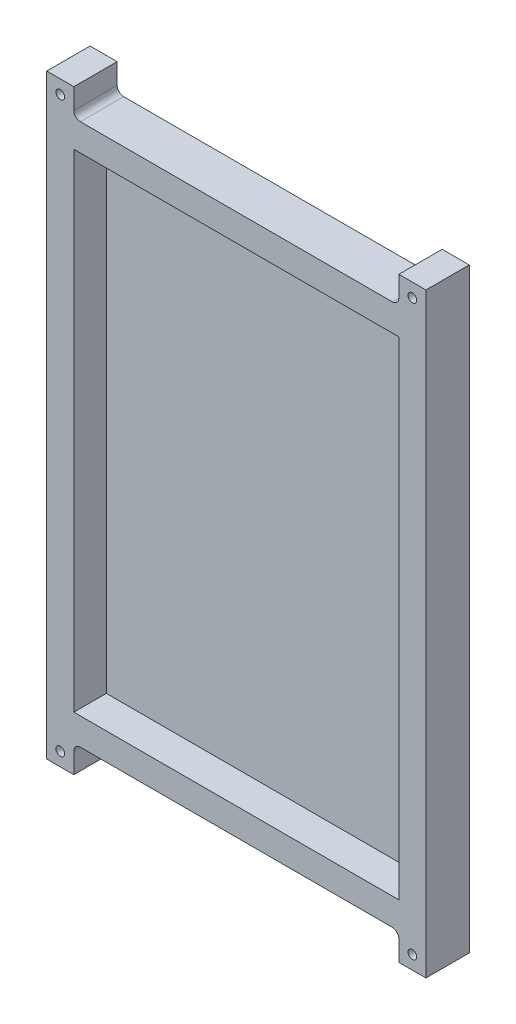
ISO-10303-21;
HEADER;
FILE_DESCRIPTION(('STEP AP214'),'2;1');
FILE_NAME('part.step','',(''),(''),'','','');
FILE_SCHEMA(('AUTOMOTIVE_DESIGN { 1 0 10303 214 1 1 1 1 }'));
ENDSEC;
DATA;
#1=APPLICATION_CONTEXT('core data for automotive mechanical design processes');
#2=APPLICATION_PROTOCOL_DEFINITION('international standard','automotive_design',2000,#1);
#3=PRODUCT_CONTEXT('',#1,'mechanical');
#4=PRODUCT('Part','Part','',(#3));
#5=PRODUCT_RELATED_PRODUCT_CATEGORY('part','',(#4));
#6=PRODUCT_DEFINITION_FORMATION('','',#4);
#7=PRODUCT_DEFINITION_CONTEXT('part definition',#1,'design');
#8=PRODUCT_DEFINITION('design','',#6,#7);
#9=PRODUCT_DEFINITION_SHAPE('','',#8);
#10=(LENGTH_UNIT() NAMED_UNIT(*) SI_UNIT(.MILLI.,.METRE.));
#11=(NAMED_UNIT(*) PLANE_ANGLE_UNIT() SI_UNIT($,.RADIAN.));
#12=(NAMED_UNIT(*) SI_UNIT($,.STERADIAN.) SOLID_ANGLE_UNIT());
#13=UNCERTAINTY_MEASURE_WITH_UNIT(LENGTH_MEASURE(1.E-05),#10,'distance_accuracy_value','');
#14=(GEOMETRIC_REPRESENTATION_CONTEXT(3) GLOBAL_UNCERTAINTY_ASSIGNED_CONTEXT((#13)) GLOBAL_UNIT_ASSIGNED_CONTEXT((#10,
#11,#12)) REPRESENTATION_CONTEXT('',''));
#15=CARTESIAN_POINT('',(0.,0.,0.));
#16=DIRECTION('',(0.,0.,1.));
#17=DIRECTION('',(1.,0.,0.));
#18=AXIS2_PLACEMENT_3D('',#15,#16,#17);
#19=CARTESIAN_POINT('',(10.,190.,4.));
#20=DIRECTION('',(-1.,0.,0.));
#21=DIRECTION('',(0.,0.,1.));
#22=AXIS2_PLACEMENT_3D('',#19,#20,#21);
#23=PLANE('',#22);
#24=DIRECTION('',(0.,1.,0.));
#25=VECTOR('',#24,1.);
#26=CARTESIAN_POINT('',(10.,190.,0.));
#27=LINE('',#26,#25);
#28=CARTESIAN_POINT('',(10.,-20.,0.));
#29=VERTEX_POINT('',#28);
#30=CARTESIAN_POINT('',(10.,200.,0.));
#31=VERTEX_POINT('',#30);
#32=EDGE_CURVE('E61',#29,#31,#27,.T.);
#33=ORIENTED_EDGE('',*,*,#32,.T.);
#34=DIRECTION('',(0.,0.,-1.));
#35=VECTOR('',#34,1.);
#36=CARTESIAN_POINT('',(10.,200.,4.));
#37=LINE('',#36,#35);
#38=CARTESIAN_POINT('',(10.,200.,16.));
#39=VERTEX_POINT('',#38);
#40=EDGE_CURVE('E11',#39,#31,#37,.T.);
#41=ORIENTED_EDGE('',*,*,#40,.F.);
#42=DIRECTION('',(0.,1.,0.));
#43=VECTOR('',#42,1.);
#44=CARTESIAN_POINT('',(10.,-20.,16.));
#45=LINE('',#44,#43);
#46=CARTESIAN_POINT('',(10.,-20.,16.));
#47=VERTEX_POINT('',#46);
#48=EDGE_CURVE('E221',#47,#39,#45,.T.);
#49=ORIENTED_EDGE('',*,*,#48,.F.);
#50=DIRECTION('',(0.,0.,-1.));
#51=VECTOR('',#50,1.);
#52=CARTESIAN_POINT('',(10.,-20.,4.));
#53=LINE('',#52,#51);
#54=EDGE_CURVE('E298',#47,#29,#53,.T.);
#55=ORIENTED_EDGE('',*,*,#54,.T.);
#56=EDGE_LOOP('',(#33,#41,#49,#55));
#57=FACE_BOUND('',#56,.T.);
#58=ADVANCED_FACE('F39',(#57),#23,.F.);
#59=CARTESIAN_POINT('',(10.,200.,4.));
#60=DIRECTION('',(0.,-1.,0.));
#61=DIRECTION('',(0.,0.,-1.));
#62=AXIS2_PLACEMENT_3D('',#59,#60,#61);
#63=PLANE('',#62);
#64=DIRECTION('',(-1.,0.,0.));
#65=VECTOR('',#64,1.);
#66=CARTESIAN_POINT('',(10.,200.,0.));
#67=LINE('',#66,#65);
#68=CARTESIAN_POINT('',(0.,200.,0.));
#69=VERTEX_POINT('',#68);
#70=EDGE_CURVE('E267',#31,#69,#67,.T.);
#71=ORIENTED_EDGE('',*,*,#70,.T.);
#72=DIRECTION('',(0.,0.,-1.));
#73=VECTOR('',#72,1.);
#74=CARTESIAN_POINT('',(0.,200.,4.));
#75=LINE('',#74,#73);
#76=CARTESIAN_POINT('',(0.,200.,16.));
#77=VERTEX_POINT('',#76);
#78=EDGE_CURVE('E46',#77,#69,#75,.T.);
#79=ORIENTED_EDGE('',*,*,#78,.F.);
#80=DIRECTION('',(-1.,0.,0.));
#81=VECTOR('',#80,1.);
#82=CARTESIAN_POINT('',(10.,200.,16.));
#83=LINE('',#82,#81);
#84=EDGE_CURVE('E224',#39,#77,#83,.T.);
#85=ORIENTED_EDGE('',*,*,#84,.F.);
#86=ORIENTED_EDGE('',*,*,#40,.T.);
#87=EDGE_LOOP('',(#71,#79,#85,#86));
#88=FACE_BOUND('',#87,.T.);
#89=ADVANCED_FACE('F400',(#88),#63,.F.);
#90=CARTESIAN_POINT('',(0.,192.4,4.));
#91=DIRECTION('',(1.,0.,0.));
#92=DIRECTION('',(0.,0.,-1.));
#93=AXIS2_PLACEMENT_3D('',#90,#91,#92);
#94=PLANE('',#93);
#95=DIRECTION('',(0.,-1.,0.));
#96=VECTOR('',#95,1.);
#97=CARTESIAN_POINT('',(0.,192.4,0.));
#98=LINE('',#97,#96);
#99=CARTESIAN_POINT('',(0.,192.4,0.));
#100=VERTEX_POINT('',#99);
#101=EDGE_CURVE('E269',#69,#100,#98,.T.);
#102=ORIENTED_EDGE('',*,*,#101,.T.);
#103=DIRECTION('',(0.,0.,-1.));
#104=VECTOR('',#103,1.);
#105=CARTESIAN_POINT('',(0.,192.4,4.));
#106=LINE('',#105,#104);
#107=CARTESIAN_POINT('',(0.,192.4,16.));
#108=VERTEX_POINT('',#107);
#109=EDGE_CURVE('E337',#108,#100,#106,.T.);
#110=ORIENTED_EDGE('',*,*,#109,.F.);
#111=DIRECTION('',(0.,-1.,0.));
#112=VECTOR('',#111,1.);
#113=CARTESIAN_POINT('',(0.,200.,16.));
#114=LINE('',#113,#112);
#115=EDGE_CURVE('E227',#77,#108,#114,.T.);
#116=ORIENTED_EDGE('',*,*,#115,.F.);
#117=ORIENTED_EDGE('',*,*,#78,.T.);
#118=EDGE_LOOP('',(#102,#110,#116,#117));
#119=FACE_BOUND('',#118,.T.);
#120=ADVANCED_FACE('F343',(#119),#94,.F.);
#121=CARTESIAN_POINT('',(-2.4,192.4,4.));
#122=DIRECTION('',(0.,0.,-1.));
#123=DIRECTION('',(-1.,0.,0.));
#124=AXIS2_PLACEMENT_3D('',#121,#122,#123);
#125=CYLINDRICAL_SURFACE('',#124,2.40000000000001);
#126=CARTESIAN_POINT('',(-2.4,192.4,0.));
#127=DIRECTION('',(0.,0.,-1.));
#128=DIRECTION('',(1.,0.,0.));
#129=AXIS2_PLACEMENT_3D('',#126,#127,#128);
#130=CIRCLE('',#129,2.40000000000001);
#131=CARTESIAN_POINT('',(-2.40000000000002,190.,0.));
#132=VERTEX_POINT('',#131);
#133=EDGE_CURVE('E271',#100,#132,#130,.T.);
#134=ORIENTED_EDGE('',*,*,#133,.T.);
#135=DIRECTION('',(0.,0.,-1.));
#136=VECTOR('',#135,1.);
#137=CARTESIAN_POINT('',(-2.40000000000002,190.,4.));
#138=LINE('',#137,#136);
#139=CARTESIAN_POINT('',(-2.40000000000002,190.,16.));
#140=VERTEX_POINT('',#139);
#141=EDGE_CURVE('E334',#140,#132,#138,.T.);
#142=ORIENTED_EDGE('',*,*,#141,.F.);
#143=CARTESIAN_POINT('',(-2.4,192.4,16.));
#144=DIRECTION('',(0.,0.,-1.));
#145=DIRECTION('',(1.,0.,0.));
#146=AXIS2_PLACEMENT_3D('',#143,#144,#145);
#147=CIRCLE('',#146,2.40000000000001);
#148=EDGE_CURVE('E230',#108,#140,#147,.T.);
#149=ORIENTED_EDGE('',*,*,#148,.F.);
#150=ORIENTED_EDGE('',*,*,#109,.T.);
#151=EDGE_LOOP('',(#134,#142,#149,#150));
#152=FACE_BOUND('',#151,.T.);
#153=ADVANCED_FACE('F351',(#152),#125,.F.);
#154=CARTESIAN_POINT('',(-2.40000000000002,190.,4.));
#155=DIRECTION('',(0.,-1.,0.));
#156=DIRECTION('',(0.,0.,-1.));
#157=AXIS2_PLACEMENT_3D('',#154,#155,#156);
#158=PLANE('',#157);
#159=DIRECTION('',(-1.,0.,0.));
#160=VECTOR('',#159,1.);
#161=CARTESIAN_POINT('',(-2.40000000000002,190.,0.));
#162=LINE('',#161,#160);
#163=CARTESIAN_POINT('',(-117.6,190.,0.));
#164=VERTEX_POINT('',#163);
#165=EDGE_CURVE('E273',#132,#164,#162,.T.);
#166=ORIENTED_EDGE('',*,*,#165,.T.);
#167=DIRECTION('',(0.,0.,-1.));
#168=VECTOR('',#167,1.);
#169=CARTESIAN_POINT('',(-117.6,190.,4.));
#170=LINE('',#169,#168);
#171=CARTESIAN_POINT('',(-117.6,190.,16.));
#172=VERTEX_POINT('',#171);
#173=EDGE_CURVE('E331',#172,#164,#170,.T.);
#174=ORIENTED_EDGE('',*,*,#173,.F.);
#175=DIRECTION('',(-1.,0.,0.));
#176=VECTOR('',#175,1.);
#177=CARTESIAN_POINT('',(-2.40000000000002,190.,16.));
#178=LINE('',#177,#176);
#179=EDGE_CURVE('E233',#140,#172,#178,.T.);
#180=ORIENTED_EDGE('',*,*,#179,.F.);
#181=ORIENTED_EDGE('',*,*,#141,.T.);
#182=EDGE_LOOP('',(#166,#174,#180,#181));
#183=FACE_BOUND('',#182,.T.);
#184=ADVANCED_FACE('F355',(#183),#158,.F.);
#185=CARTESIAN_POINT('',(-117.6,192.4,4.));
#186=DIRECTION('',(0.,0.,-1.));
#187=DIRECTION('',(-1.,0.,0.));
#188=AXIS2_PLACEMENT_3D('',#185,#186,#187);
#189=CYLINDRICAL_SURFACE('',#188,2.40000000000001);
#190=CARTESIAN_POINT('',(-117.6,192.4,0.));
#191=DIRECTION('',(0.,0.,-1.));
#192=DIRECTION('',(-1.,0.,0.));
#193=AXIS2_PLACEMENT_3D('',#190,#191,#192);
#194=CIRCLE('',#193,2.40000000000001);
#195=CARTESIAN_POINT('',(-120.,192.4,0.));
#196=VERTEX_POINT('',#195);
#197=EDGE_CURVE('E275',#164,#196,#194,.T.);
#198=ORIENTED_EDGE('',*,*,#197,.T.);
#199=DIRECTION('',(0.,0.,-1.));
#200=VECTOR('',#199,1.);
#201=CARTESIAN_POINT('',(-120.,192.4,4.));
#202=LINE('',#201,#200);
#203=CARTESIAN_POINT('',(-120.,192.4,16.));
#204=VERTEX_POINT('',#203);
#205=EDGE_CURVE('E328',#204,#196,#202,.T.);
#206=ORIENTED_EDGE('',*,*,#205,.F.);
#207=CARTESIAN_POINT('',(-117.6,192.4,16.));
#208=DIRECTION('',(0.,0.,-1.));
#209=DIRECTION('',(1.,0.,0.));
#210=AXIS2_PLACEMENT_3D('',#207,#208,#209);
#211=CIRCLE('',#210,2.40000000000001);
#212=EDGE_CURVE('E236',#172,#204,#211,.T.);
#213=ORIENTED_EDGE('',*,*,#212,.F.);
#214=ORIENTED_EDGE('',*,*,#173,.T.);
#215=EDGE_LOOP('',(#198,#206,#213,#214));
#216=FACE_BOUND('',#215,.T.);
#217=ADVANCED_FACE('F360',(#216),#189,.F.);
#218=CARTESIAN_POINT('',(-120.,192.4,4.));
#219=DIRECTION('',(-1.,0.,0.));
#220=DIRECTION('',(0.,0.,1.));
#221=AXIS2_PLACEMENT_3D('',#218,#219,#220);
#222=PLANE('',#221);
#223=DIRECTION('',(0.,1.,0.));
#224=VECTOR('',#223,1.);
#225=CARTESIAN_POINT('',(-120.,192.4,0.));
#226=LINE('',#225,#224);
#227=CARTESIAN_POINT('',(-120.,200.,0.));
#228=VERTEX_POINT('',#227);
#229=EDGE_CURVE('E277',#196,#228,#226,.T.);
#230=ORIENTED_EDGE('',*,*,#229,.T.);
#231=DIRECTION('',(0.,0.,-1.));
#232=VECTOR('',#231,1.);
#233=CARTESIAN_POINT('',(-120.,200.,4.));
#234=LINE('',#233,#232);
#235=CARTESIAN_POINT('',(-120.,200.,16.));
#236=VERTEX_POINT('',#235);
#237=EDGE_CURVE('E325',#236,#228,#234,.T.);
#238=ORIENTED_EDGE('',*,*,#237,.F.);
#239=DIRECTION('',(0.,1.,0.));
#240=VECTOR('',#239,1.);
#241=CARTESIAN_POINT('',(-120.,192.4,16.));
#242=LINE('',#241,#240);
#243=EDGE_CURVE('E239',#204,#236,#242,.T.);
#244=ORIENTED_EDGE('',*,*,#243,.F.);
#245=ORIENTED_EDGE('',*,*,#205,.T.);
#246=EDGE_LOOP('',(#230,#238,#244,#245));
#247=FACE_BOUND('',#246,.T.);
#248=ADVANCED_FACE('F363',(#247),#222,.F.);
#249=CARTESIAN_POINT('',(-130.,200.,4.));
#250=DIRECTION('',(0.,-1.,0.));
#251=DIRECTION('',(0.,0.,-1.));
#252=AXIS2_PLACEMENT_3D('',#249,#250,#251);
#253=PLANE('',#252);
#254=DIRECTION('',(-1.,0.,0.));
#255=VECTOR('',#254,1.);
#256=CARTESIAN_POINT('',(-130.,200.,0.));
#257=LINE('',#256,#255);
#258=CARTESIAN_POINT('',(-130.,200.,0.));
#259=VERTEX_POINT('',#258);
#260=EDGE_CURVE('E279',#228,#259,#257,.T.);
#261=ORIENTED_EDGE('',*,*,#260,.T.);
#262=DIRECTION('',(0.,0.,-1.));
#263=VECTOR('',#262,1.);
#264=CARTESIAN_POINT('',(-130.,200.,4.));
#265=LINE('',#264,#263);
#266=CARTESIAN_POINT('',(-130.,200.,16.));
#267=VERTEX_POINT('',#266);
#268=EDGE_CURVE('E322',#267,#259,#265,.T.);
#269=ORIENTED_EDGE('',*,*,#268,.F.);
#270=DIRECTION('',(-1.,0.,0.));
#271=VECTOR('',#270,1.);
#272=CARTESIAN_POINT('',(-120.,200.,16.));
#273=LINE('',#272,#271);
#274=EDGE_CURVE('E242',#236,#267,#273,.T.);
#275=ORIENTED_EDGE('',*,*,#274,.F.);
#276=ORIENTED_EDGE('',*,*,#237,.T.);
#277=EDGE_LOOP('',(#261,#269,#275,#276));
#278=FACE_BOUND('',#277,.T.);
#279=ADVANCED_FACE('F367',(#278),#253,.F.);
#280=CARTESIAN_POINT('',(-130.,-10.,4.));
#281=DIRECTION('',(1.,0.,0.));
#282=DIRECTION('',(0.,0.,-1.));
#283=AXIS2_PLACEMENT_3D('',#280,#281,#282);
#284=PLANE('',#283);
#285=DIRECTION('',(0.,-1.,0.));
#286=VECTOR('',#285,1.);
#287=CARTESIAN_POINT('',(-130.,-10.,0.));
#288=LINE('',#287,#286);
#289=CARTESIAN_POINT('',(-130.,-20.,0.));
#290=VERTEX_POINT('',#289);
#291=EDGE_CURVE('E282',#259,#290,#288,.T.);
#292=ORIENTED_EDGE('',*,*,#291,.T.);
#293=DIRECTION('',(0.,0.,-1.));
#294=VECTOR('',#293,1.);
#295=CARTESIAN_POINT('',(-130.,-20.,4.));
#296=LINE('',#295,#294);
#297=CARTESIAN_POINT('',(-130.,-20.,16.));
#298=VERTEX_POINT('',#297);
#299=EDGE_CURVE('E319',#298,#290,#296,.T.);
#300=ORIENTED_EDGE('',*,*,#299,.F.);
#301=DIRECTION('',(0.,-1.,0.));
#302=VECTOR('',#301,1.);
#303=CARTESIAN_POINT('',(-130.,200.,16.));
#304=LINE('',#303,#302);
#305=EDGE_CURVE('E245',#267,#298,#304,.T.);
#306=ORIENTED_EDGE('',*,*,#305,.F.);
#307=ORIENTED_EDGE('',*,*,#268,.T.);
#308=EDGE_LOOP('',(#292,#300,#306,#307));
#309=FACE_BOUND('',#308,.T.);
#310=ADVANCED_FACE('F371',(#309),#284,.F.);
#311=CARTESIAN_POINT('',(-130.,-20.,4.));
#312=DIRECTION('',(0.,1.,0.));
#313=DIRECTION('',(0.,0.,1.));
#314=AXIS2_PLACEMENT_3D('',#311,#312,#313);
#315=PLANE('',#314);
#316=DIRECTION('',(1.,0.,0.));
#317=VECTOR('',#316,1.);
#318=CARTESIAN_POINT('',(-130.,-20.,0.));
#319=LINE('',#318,#317);
#320=CARTESIAN_POINT('',(-120.,-20.,0.));
#321=VERTEX_POINT('',#320);
#322=EDGE_CURVE('E284',#290,#321,#319,.T.);
#323=ORIENTED_EDGE('',*,*,#322,.T.);
#324=DIRECTION('',(0.,0.,-1.));
#325=VECTOR('',#324,1.);
#326=CARTESIAN_POINT('',(-120.,-20.,4.));
#327=LINE('',#326,#325);
#328=CARTESIAN_POINT('',(-120.,-20.,16.));
#329=VERTEX_POINT('',#328);
#330=EDGE_CURVE('E316',#329,#321,#327,.T.);
#331=ORIENTED_EDGE('',*,*,#330,.F.);
#332=DIRECTION('',(1.,0.,0.));
#333=VECTOR('',#332,1.);
#334=CARTESIAN_POINT('',(-130.,-20.,16.));
#335=LINE('',#334,#333);
#336=EDGE_CURVE('E248',#298,#329,#335,.T.);
#337=ORIENTED_EDGE('',*,*,#336,.F.);
#338=ORIENTED_EDGE('',*,*,#299,.T.);
#339=EDGE_LOOP('',(#323,#331,#337,#338));
#340=FACE_BOUND('',#339,.T.);
#341=ADVANCED_FACE('F375',(#340),#315,.F.);
#342=CARTESIAN_POINT('',(-120.,-12.4,4.));
#343=DIRECTION('',(-1.,0.,0.));
#344=DIRECTION('',(0.,0.,1.));
#345=AXIS2_PLACEMENT_3D('',#342,#343,#344);
#346=PLANE('',#345);
#347=DIRECTION('',(0.,1.,0.));
#348=VECTOR('',#347,1.);
#349=CARTESIAN_POINT('',(-120.,-12.4,0.));
#350=LINE('',#349,#348);
#351=CARTESIAN_POINT('',(-120.,-12.4,0.));
#352=VERTEX_POINT('',#351);
#353=EDGE_CURVE('E286',#321,#352,#350,.T.);
#354=ORIENTED_EDGE('',*,*,#353,.T.);
#355=DIRECTION('',(0.,0.,-1.));
#356=VECTOR('',#355,1.);
#357=CARTESIAN_POINT('',(-120.,-12.4,4.));
#358=LINE('',#357,#356);
#359=CARTESIAN_POINT('',(-120.,-12.4,16.));
#360=VERTEX_POINT('',#359);
#361=EDGE_CURVE('E313',#360,#352,#358,.T.);
#362=ORIENTED_EDGE('',*,*,#361,.F.);
#363=DIRECTION('',(0.,1.,0.));
#364=VECTOR('',#363,1.);
#365=CARTESIAN_POINT('',(-120.,-20.,16.));
#366=LINE('',#365,#364);
#367=EDGE_CURVE('E251',#329,#360,#366,.T.);
#368=ORIENTED_EDGE('',*,*,#367,.F.);
#369=ORIENTED_EDGE('',*,*,#330,.T.);
#370=EDGE_LOOP('',(#354,#362,#368,#369));
#371=FACE_BOUND('',#370,.T.);
#372=ADVANCED_FACE('F378',(#371),#346,.F.);
#373=CARTESIAN_POINT('',(-117.6,-12.4,4.));
#374=DIRECTION('',(0.,0.,-1.));
#375=DIRECTION('',(-1.,0.,0.));
#376=AXIS2_PLACEMENT_3D('',#373,#374,#375);
#377=CYLINDRICAL_SURFACE('',#376,2.4);
#378=CARTESIAN_POINT('',(-117.6,-12.4,0.));
#379=DIRECTION('',(0.,0.,-1.));
#380=DIRECTION('',(1.,0.,0.));
#381=AXIS2_PLACEMENT_3D('',#378,#379,#380);
#382=CIRCLE('',#381,2.4);
#383=CARTESIAN_POINT('',(-117.6,-10.,0.));
#384=VERTEX_POINT('',#383);
#385=EDGE_CURVE('E288',#352,#384,#382,.T.);
#386=ORIENTED_EDGE('',*,*,#385,.T.);
#387=DIRECTION('',(0.,0.,-1.));
#388=VECTOR('',#387,1.);
#389=CARTESIAN_POINT('',(-117.6,-10.,4.));
#390=LINE('',#389,#388);
#391=CARTESIAN_POINT('',(-117.6,-10.,16.));
#392=VERTEX_POINT('',#391);
#393=EDGE_CURVE('E310',#392,#384,#390,.T.);
#394=ORIENTED_EDGE('',*,*,#393,.F.);
#395=CARTESIAN_POINT('',(-117.6,-12.4,16.));
#396=DIRECTION('',(0.,0.,-1.));
#397=DIRECTION('',(1.,0.,0.));
#398=AXIS2_PLACEMENT_3D('',#395,#396,#397);
#399=CIRCLE('',#398,2.4);
#400=EDGE_CURVE('E254',#360,#392,#399,.T.);
#401=ORIENTED_EDGE('',*,*,#400,.F.);
#402=ORIENTED_EDGE('',*,*,#361,.T.);
#403=EDGE_LOOP('',(#386,#394,#401,#402));
#404=FACE_BOUND('',#403,.T.);
#405=ADVANCED_FACE('F383',(#404),#377,.F.);
#406=CARTESIAN_POINT('',(-2.40000000000002,-10.,4.));
#407=DIRECTION('',(0.,1.,0.));
#408=DIRECTION('',(0.,0.,1.));
#409=AXIS2_PLACEMENT_3D('',#406,#407,#408);
#410=PLANE('',#409);
#411=DIRECTION('',(1.,0.,0.));
#412=VECTOR('',#411,1.);
#413=CARTESIAN_POINT('',(-2.40000000000002,-10.,0.));
#414=LINE('',#413,#412);
#415=CARTESIAN_POINT('',(-2.40000000000002,-10.,0.));
#416=VERTEX_POINT('',#415);
#417=EDGE_CURVE('E290',#384,#416,#414,.T.);
#418=ORIENTED_EDGE('',*,*,#417,.T.);
#419=DIRECTION('',(0.,0.,-1.));
#420=VECTOR('',#419,1.);
#421=CARTESIAN_POINT('',(-2.40000000000002,-10.,4.));
#422=LINE('',#421,#420);
#423=CARTESIAN_POINT('',(-2.40000000000002,-10.,16.));
#424=VERTEX_POINT('',#423);
#425=EDGE_CURVE('E307',#424,#416,#422,.T.);
#426=ORIENTED_EDGE('',*,*,#425,.F.);
#427=DIRECTION('',(1.,0.,0.));
#428=VECTOR('',#427,1.);
#429=CARTESIAN_POINT('',(-117.6,-10.,16.));
#430=LINE('',#429,#428);
#431=EDGE_CURVE('E257',#392,#424,#430,.T.);
#432=ORIENTED_EDGE('',*,*,#431,.F.);
#433=ORIENTED_EDGE('',*,*,#393,.T.);
#434=EDGE_LOOP('',(#418,#426,#432,#433));
#435=FACE_BOUND('',#434,.T.);
#436=ADVANCED_FACE('F387',(#435),#410,.F.);
#437=CARTESIAN_POINT('',(-2.4,-12.4,4.));
#438=DIRECTION('',(0.,0.,-1.));
#439=DIRECTION('',(-1.,0.,0.));
#440=AXIS2_PLACEMENT_3D('',#437,#438,#439);
#441=CYLINDRICAL_SURFACE('',#440,2.4);
#442=CARTESIAN_POINT('',(-2.4,-12.4,0.));
#443=DIRECTION('',(0.,0.,-1.));
#444=DIRECTION('',(-1.,0.,0.));
#445=AXIS2_PLACEMENT_3D('',#442,#443,#444);
#446=CIRCLE('',#445,2.4);
#447=CARTESIAN_POINT('',(0.,-12.4,0.));
#448=VERTEX_POINT('',#447);
#449=EDGE_CURVE('E292',#416,#448,#446,.T.);
#450=ORIENTED_EDGE('',*,*,#449,.T.);
#451=DIRECTION('',(0.,0.,-1.));
#452=VECTOR('',#451,1.);
#453=CARTESIAN_POINT('',(0.,-12.4,4.));
#454=LINE('',#453,#452);
#455=CARTESIAN_POINT('',(0.,-12.4,16.));
#456=VERTEX_POINT('',#455);
#457=EDGE_CURVE('E304',#456,#448,#454,.T.);
#458=ORIENTED_EDGE('',*,*,#457,.F.);
#459=CARTESIAN_POINT('',(-2.4,-12.4,16.));
#460=DIRECTION('',(0.,0.,-1.));
#461=DIRECTION('',(1.,0.,0.));
#462=AXIS2_PLACEMENT_3D('',#459,#460,#461);
#463=CIRCLE('',#462,2.4);
#464=EDGE_CURVE('E260',#424,#456,#463,.T.);
#465=ORIENTED_EDGE('',*,*,#464,.F.);
#466=ORIENTED_EDGE('',*,*,#425,.T.);
#467=EDGE_LOOP('',(#450,#458,#465,#466));
#468=FACE_BOUND('',#467,.T.);
#469=ADVANCED_FACE('F391',(#468),#441,.F.);
#470=CARTESIAN_POINT('',(0.,-12.4,4.));
#471=DIRECTION('',(1.,0.,0.));
#472=DIRECTION('',(0.,1.,0.));
#473=AXIS2_PLACEMENT_3D('',#470,#471,#472);
#474=PLANE('',#473);
#475=DIRECTION('',(0.,-1.,0.));
#476=VECTOR('',#475,1.);
#477=CARTESIAN_POINT('',(0.,-12.4,0.));
#478=LINE('',#477,#476);
#479=CARTESIAN_POINT('',(0.,-20.,0.));
#480=VERTEX_POINT('',#479);
#481=EDGE_CURVE('E294',#448,#480,#478,.T.);
#482=ORIENTED_EDGE('',*,*,#481,.T.);
#483=DIRECTION('',(0.,0.,-1.));
#484=VECTOR('',#483,1.);
#485=CARTESIAN_POINT('',(0.,-20.,4.));
#486=LINE('',#485,#484);
#487=CARTESIAN_POINT('',(0.,-20.,16.));
#488=VERTEX_POINT('',#487);
#489=EDGE_CURVE('E301',#488,#480,#486,.T.);
#490=ORIENTED_EDGE('',*,*,#489,.F.);
#491=DIRECTION('',(0.,-1.,0.));
#492=VECTOR('',#491,1.);
#493=CARTESIAN_POINT('',(0.,-12.4,16.));
#494=LINE('',#493,#492);
#495=EDGE_CURVE('E263',#456,#488,#494,.T.);
#496=ORIENTED_EDGE('',*,*,#495,.F.);
#497=ORIENTED_EDGE('',*,*,#457,.T.);
#498=EDGE_LOOP('',(#482,#490,#496,#497));
#499=FACE_BOUND('',#498,.T.);
#500=ADVANCED_FACE('F394',(#499),#474,.F.);
#501=CARTESIAN_POINT('',(10.,-20.,4.));
#502=DIRECTION('',(0.,1.,0.));
#503=DIRECTION('',(0.,0.,1.));
#504=AXIS2_PLACEMENT_3D('',#501,#502,#503);
#505=PLANE('',#504);
#506=DIRECTION('',(1.,0.,0.));
#507=VECTOR('',#506,1.);
#508=CARTESIAN_POINT('',(10.,-20.,0.));
#509=LINE('',#508,#507);
#510=EDGE_CURVE('E296',#480,#29,#509,.T.);
#511=ORIENTED_EDGE('',*,*,#510,.T.);
#512=ORIENTED_EDGE('',*,*,#54,.F.);
#513=DIRECTION('',(1.,0.,0.));
#514=VECTOR('',#513,1.);
#515=CARTESIAN_POINT('',(0.,-20.,16.));
#516=LINE('',#515,#514);
#517=EDGE_CURVE('E193',#488,#47,#516,.T.);
#518=ORIENTED_EDGE('',*,*,#517,.F.);
#519=ORIENTED_EDGE('',*,*,#489,.T.);
#520=EDGE_LOOP('',(#511,#512,#518,#519));
#521=FACE_BOUND('',#520,.T.);
#522=ADVANCED_FACE('F396',(#521),#505,.F.);
#523=CARTESIAN_POINT('',(-2.4,-12.4,0.));
#524=DIRECTION('',(0.,0.,-1.));
#525=DIRECTION('',(-1.,0.,0.));
#526=AXIS2_PLACEMENT_3D('',#523,#524,#525);
#527=PLANE('',#526);
#528=ORIENTED_EDGE('',*,*,#32,.F.);
#529=ORIENTED_EDGE('',*,*,#510,.F.);
#530=ORIENTED_EDGE('',*,*,#481,.F.);
#531=ORIENTED_EDGE('',*,*,#449,.F.);
#532=ORIENTED_EDGE('',*,*,#417,.F.);
#533=ORIENTED_EDGE('',*,*,#385,.F.);
#534=ORIENTED_EDGE('',*,*,#353,.F.);
#535=ORIENTED_EDGE('',*,*,#322,.F.);
#536=ORIENTED_EDGE('',*,*,#291,.F.);
#537=ORIENTED_EDGE('',*,*,#260,.F.);
#538=ORIENTED_EDGE('',*,*,#229,.F.);
#539=ORIENTED_EDGE('',*,*,#197,.F.);
#540=ORIENTED_EDGE('',*,*,#165,.F.);
#541=ORIENTED_EDGE('',*,*,#133,.F.);
#542=ORIENTED_EDGE('',*,*,#101,.F.);
#543=ORIENTED_EDGE('',*,*,#70,.F.);
#544=EDGE_LOOP('',(#528,#529,#530,#531,#532,#533,#534,#535,#536,#537,#538,#539,#540,#541,#542,#543));
#545=FACE_BOUND('',#544,.T.);
#546=ADVANCED_FACE('F347',(#545),#527,.T.);
#547=CARTESIAN_POINT('',(-2.4,192.4,16.));
#548=DIRECTION('',(0.,0.,1.));
#549=DIRECTION('',(1.,0.,0.));
#550=AXIS2_PLACEMENT_3D('',#547,#548,#549);
#551=PLANE('',#550);
#552=CARTESIAN_POINT('',(-125.,-15.0000000000001,16.));
#553=DIRECTION('',(0.,0.,1.));
#554=DIRECTION('',(-1.,0.,0.));
#555=AXIS2_PLACEMENT_3D('',#552,#553,#554);
#556=CIRCLE('',#555,1.6);
#557=CARTESIAN_POINT('',(-126.6,-15.0000000000001,16.));
#558=VERTEX_POINT('',#557);
#559=EDGE_CURVE('E506',#558,#558,#556,.T.);
#560=ORIENTED_EDGE('',*,*,#559,.F.);
#561=EDGE_LOOP('',(#560));
#562=FACE_BOUND('',#561,.T.);
#563=CARTESIAN_POINT('',(5.,-15.0000000000001,16.));
#564=DIRECTION('',(0.,0.,1.));
#565=DIRECTION('',(1.,0.,0.));
#566=AXIS2_PLACEMENT_3D('',#563,#564,#565);
#567=CIRCLE('',#566,1.6);
#568=CARTESIAN_POINT('',(6.6,-15.0000000000001,16.));
#569=VERTEX_POINT('',#568);
#570=EDGE_CURVE('E498',#569,#569,#567,.T.);
#571=ORIENTED_EDGE('',*,*,#570,.F.);
#572=EDGE_LOOP('',(#571));
#573=FACE_BOUND('',#572,.T.);
#574=CARTESIAN_POINT('',(5.,195.,16.));
#575=DIRECTION('',(0.,0.,1.));
#576=DIRECTION('',(-1.,0.,0.));
#577=AXIS2_PLACEMENT_3D('',#574,#575,#576);
#578=CIRCLE('',#577,1.6);
#579=CARTESIAN_POINT('',(3.4,195.,16.));
#580=VERTEX_POINT('',#579);
#581=EDGE_CURVE('E493',#580,#580,#578,.T.);
#582=ORIENTED_EDGE('',*,*,#581,.F.);
#583=EDGE_LOOP('',(#582));
#584=FACE_BOUND('',#583,.T.);
#585=CARTESIAN_POINT('',(-125.,195.,16.));
#586=DIRECTION('',(0.,0.,1.));
#587=DIRECTION('',(1.,0.,0.));
#588=AXIS2_PLACEMENT_3D('',#585,#586,#587);
#589=CIRCLE('',#588,1.6);
#590=CARTESIAN_POINT('',(-123.4,195.,16.));
#591=VERTEX_POINT('',#590);
#592=EDGE_CURVE('E495',#591,#591,#589,.T.);
#593=ORIENTED_EDGE('',*,*,#592,.F.);
#594=EDGE_LOOP('',(#593));
#595=FACE_BOUND('',#594,.T.);
#596=ORIENTED_EDGE('',*,*,#517,.T.);
#597=ORIENTED_EDGE('',*,*,#48,.T.);
#598=ORIENTED_EDGE('',*,*,#84,.T.);
#599=ORIENTED_EDGE('',*,*,#115,.T.);
#600=ORIENTED_EDGE('',*,*,#148,.T.);
#601=ORIENTED_EDGE('',*,*,#179,.T.);
#602=ORIENTED_EDGE('',*,*,#212,.T.);
#603=ORIENTED_EDGE('',*,*,#243,.T.);
#604=ORIENTED_EDGE('',*,*,#274,.T.);
#605=ORIENTED_EDGE('',*,*,#305,.T.);
#606=ORIENTED_EDGE('',*,*,#336,.T.);
#607=ORIENTED_EDGE('',*,*,#367,.T.);
#608=ORIENTED_EDGE('',*,*,#400,.T.);
#609=ORIENTED_EDGE('',*,*,#431,.T.);
#610=ORIENTED_EDGE('',*,*,#464,.T.);
#611=ORIENTED_EDGE('',*,*,#495,.T.);
#612=EDGE_LOOP('',(#596,#597,#598,#599,#600,#601,#602,#603,#604,#605,#606,#607,#608,#609,#610,#611));
#613=FACE_BOUND('',#612,.T.);
#614=DIRECTION('',(-1.,0.,0.));
#615=VECTOR('',#614,1.);
#616=CARTESIAN_POINT('',(0.,180.,16.));
#617=LINE('',#616,#615);
#618=CARTESIAN_POINT('',(0.,180.,16.));
#619=VERTEX_POINT('',#618);
#620=CARTESIAN_POINT('',(-120.,180.,16.));
#621=VERTEX_POINT('',#620);
#622=EDGE_CURVE('E185',#619,#621,#617,.T.);
#623=ORIENTED_EDGE('',*,*,#622,.F.);
#624=DIRECTION('',(0.,1.,0.));
#625=VECTOR('',#624,1.);
#626=CARTESIAN_POINT('',(0.,0.,16.));
#627=LINE('',#626,#625);
#628=CARTESIAN_POINT('',(0.,0.,16.));
#629=VERTEX_POINT('',#628);
#630=EDGE_CURVE('E177',#629,#619,#627,.T.);
#631=ORIENTED_EDGE('',*,*,#630,.F.);
#632=DIRECTION('',(1.,0.,0.));
#633=VECTOR('',#632,1.);
#634=CARTESIAN_POINT('',(-120.,0.,16.));
#635=LINE('',#634,#633);
#636=CARTESIAN_POINT('',(-120.,0.,16.));
#637=VERTEX_POINT('',#636);
#638=EDGE_CURVE('E201',#637,#629,#635,.T.);
#639=ORIENTED_EDGE('',*,*,#638,.F.);
#640=DIRECTION('',(0.,-1.,0.));
#641=VECTOR('',#640,1.);
#642=CARTESIAN_POINT('',(-120.,180.,16.));
#643=LINE('',#642,#641);
#644=EDGE_CURVE('E199',#621,#637,#643,.T.);
#645=ORIENTED_EDGE('',*,*,#644,.F.);
#646=EDGE_LOOP('',(#623,#631,#639,#645));
#647=FACE_BOUND('',#646,.T.);
#648=ADVANCED_FACE('F197',(#562,#573,#584,#595,#613,#647),#551,.T.);
#649=CARTESIAN_POINT('',(0.,0.,16.));
#650=DIRECTION('',(-1.,0.,0.));
#651=DIRECTION('',(0.,0.,1.));
#652=AXIS2_PLACEMENT_3D('',#649,#650,#651);
#653=PLANE('',#652);
#654=DIRECTION('',(0.,1.,0.));
#655=VECTOR('',#654,1.);
#656=CARTESIAN_POINT('',(0.,0.,4.));
#657=LINE('',#656,#655);
#658=CARTESIAN_POINT('',(0.,0.,4.));
#659=VERTEX_POINT('',#658);
#660=CARTESIAN_POINT('',(0.,180.,4.));
#661=VERTEX_POINT('',#660);
#662=EDGE_CURVE('E206',#659,#661,#657,.T.);
#663=ORIENTED_EDGE('',*,*,#662,.F.);
#664=DIRECTION('',(0.,0.,-1.));
#665=VECTOR('',#664,1.);
#666=CARTESIAN_POINT('',(0.,0.,16.));
#667=LINE('',#666,#665);
#668=EDGE_CURVE('E53',#629,#659,#667,.T.);
#669=ORIENTED_EDGE('',*,*,#668,.F.);
#670=ORIENTED_EDGE('',*,*,#630,.T.);
#671=DIRECTION('',(0.,0.,-1.));
#672=VECTOR('',#671,1.);
#673=CARTESIAN_POINT('',(0.,180.,16.));
#674=LINE('',#673,#672);
#675=EDGE_CURVE('E180',#619,#661,#674,.T.);
#676=ORIENTED_EDGE('',*,*,#675,.T.);
#677=EDGE_LOOP('',(#663,#669,#670,#676));
#678=FACE_BOUND('',#677,.T.);
#679=ADVANCED_FACE('F179',(#678),#653,.T.);
#680=CARTESIAN_POINT('',(0.,180.,16.));
#681=DIRECTION('',(0.,-1.,0.));
#682=DIRECTION('',(0.,0.,-1.));
#683=AXIS2_PLACEMENT_3D('',#680,#681,#682);
#684=PLANE('',#683);
#685=DIRECTION('',(-1.,0.,0.));
#686=VECTOR('',#685,1.);
#687=CARTESIAN_POINT('',(0.,180.,4.));
#688=LINE('',#687,#686);
#689=CARTESIAN_POINT('',(-120.,180.,4.));
#690=VERTEX_POINT('',#689);
#691=EDGE_CURVE('E192',#661,#690,#688,.T.);
#692=ORIENTED_EDGE('',*,*,#691,.F.);
#693=ORIENTED_EDGE('',*,*,#675,.F.);
#694=ORIENTED_EDGE('',*,*,#622,.T.);
#695=DIRECTION('',(0.,0.,-1.));
#696=VECTOR('',#695,1.);
#697=CARTESIAN_POINT('',(-120.,180.,16.));
#698=LINE('',#697,#696);
#699=EDGE_CURVE('E194',#621,#690,#698,.T.);
#700=ORIENTED_EDGE('',*,*,#699,.T.);
#701=EDGE_LOOP('',(#692,#693,#694,#700));
#702=FACE_BOUND('',#701,.T.);
#703=ADVANCED_FACE('F189',(#702),#684,.T.);
#704=CARTESIAN_POINT('',(-120.,180.,16.));
#705=DIRECTION('',(1.,0.,0.));
#706=DIRECTION('',(0.,0.,-1.));
#707=AXIS2_PLACEMENT_3D('',#704,#705,#706);
#708=PLANE('',#707);
#709=DIRECTION('',(0.,-1.,0.));
#710=VECTOR('',#709,1.);
#711=CARTESIAN_POINT('',(-120.,180.,4.));
#712=LINE('',#711,#710);
#713=CARTESIAN_POINT('',(-120.,0.,4.));
#714=VERTEX_POINT('',#713);
#715=EDGE_CURVE('E210',#690,#714,#712,.T.);
#716=ORIENTED_EDGE('',*,*,#715,.F.);
#717=ORIENTED_EDGE('',*,*,#699,.F.);
#718=ORIENTED_EDGE('',*,*,#644,.T.);
#719=DIRECTION('',(0.,0.,-1.));
#720=VECTOR('',#719,1.);
#721=CARTESIAN_POINT('',(-120.,0.,16.));
#722=LINE('',#721,#720);
#723=EDGE_CURVE('E216',#637,#714,#722,.T.);
#724=ORIENTED_EDGE('',*,*,#723,.T.);
#725=EDGE_LOOP('',(#716,#717,#718,#724));
#726=FACE_BOUND('',#725,.T.);
#727=ADVANCED_FACE('F449',(#726),#708,.T.);
#728=CARTESIAN_POINT('',(-120.,0.,16.));
#729=DIRECTION('',(0.,1.,0.));
#730=DIRECTION('',(0.,0.,1.));
#731=AXIS2_PLACEMENT_3D('',#728,#729,#730);
#732=PLANE('',#731);
#733=DIRECTION('',(1.,0.,0.));
#734=VECTOR('',#733,1.);
#735=CARTESIAN_POINT('',(-120.,0.,4.));
#736=LINE('',#735,#734);
#737=EDGE_CURVE('E186',#714,#659,#736,.T.);
#738=ORIENTED_EDGE('',*,*,#737,.F.);
#739=ORIENTED_EDGE('',*,*,#723,.F.);
#740=ORIENTED_EDGE('',*,*,#638,.T.);
#741=ORIENTED_EDGE('',*,*,#668,.T.);
#742=EDGE_LOOP('',(#738,#739,#740,#741));
#743=FACE_BOUND('',#742,.T.);
#744=ADVANCED_FACE('F440',(#743),#732,.T.);
#745=CARTESIAN_POINT('',(-2.4,-12.4,4.));
#746=DIRECTION('',(0.,0.,-1.));
#747=DIRECTION('',(-1.,0.,0.));
#748=AXIS2_PLACEMENT_3D('',#745,#746,#747);
#749=PLANE('',#748);
#750=ORIENTED_EDGE('',*,*,#737,.T.);
#751=ORIENTED_EDGE('',*,*,#662,.T.);
#752=ORIENTED_EDGE('',*,*,#691,.T.);
#753=ORIENTED_EDGE('',*,*,#715,.T.);
#754=EDGE_LOOP('',(#750,#751,#752,#753));
#755=FACE_BOUND('',#754,.T.);
#756=ADVANCED_FACE('F436',(#755),#749,.F.);
#757=CARTESIAN_POINT('',(-125.,195.,4.));
#758=DIRECTION('',(0.,0.,1.));
#759=DIRECTION('',(1.,0.,0.));
#760=AXIS2_PLACEMENT_3D('',#757,#758,#759);
#761=CYLINDRICAL_SURFACE('',#760,1.6);
#762=CARTESIAN_POINT('',(-125.,195.,4.));
#763=DIRECTION('',(0.,0.,1.));
#764=DIRECTION('',(1.,0.,0.));
#765=AXIS2_PLACEMENT_3D('',#762,#763,#764);
#766=CIRCLE('',#765,1.6);
#767=CARTESIAN_POINT('',(-123.4,195.,4.));
#768=VERTEX_POINT('',#767);
#769=EDGE_CURVE('E208',#768,#768,#766,.T.);
#770=ORIENTED_EDGE('',*,*,#769,.F.);
#771=EDGE_LOOP('',(#770));
#772=FACE_BOUND('',#771,.T.);
#773=ORIENTED_EDGE('',*,*,#592,.T.);
#774=EDGE_LOOP('',(#773));
#775=FACE_BOUND('',#774,.T.);
#776=ADVANCED_FACE('F439',(#772,#775),#761,.F.);
#777=CARTESIAN_POINT('',(-125.,195.,4.));
#778=DIRECTION('',(0.,0.,1.));
#779=DIRECTION('',(1.,0.,0.));
#780=AXIS2_PLACEMENT_3D('',#777,#778,#779);
#781=PLANE('',#780);
#782=ORIENTED_EDGE('',*,*,#769,.T.);
#783=EDGE_LOOP('',(#782));
#784=FACE_BOUND('',#783,.T.);
#785=ADVANCED_FACE('F457',(#784),#781,.T.);
#786=CARTESIAN_POINT('',(5.,195.,4.));
#787=DIRECTION('',(0.,0.,1.));
#788=DIRECTION('',(1.,0.,0.));
#789=AXIS2_PLACEMENT_3D('',#786,#787,#788);
#790=CYLINDRICAL_SURFACE('',#789,1.6);
#791=CARTESIAN_POINT('',(5.,195.,4.));
#792=DIRECTION('',(0.,0.,1.));
#793=DIRECTION('',(-1.,0.,0.));
#794=AXIS2_PLACEMENT_3D('',#791,#792,#793);
#795=CIRCLE('',#794,1.6);
#796=CARTESIAN_POINT('',(3.4,195.,4.));
#797=VERTEX_POINT('',#796);
#798=EDGE_CURVE('E490',#797,#797,#795,.T.);
#799=ORIENTED_EDGE('',*,*,#798,.F.);
#800=EDGE_LOOP('',(#799));
#801=FACE_BOUND('',#800,.T.);
#802=ORIENTED_EDGE('',*,*,#581,.T.);
#803=EDGE_LOOP('',(#802));
#804=FACE_BOUND('',#803,.T.);
#805=ADVANCED_FACE('F461',(#801,#804),#790,.F.);
#806=CARTESIAN_POINT('',(5.,195.,4.));
#807=DIRECTION('',(0.,0.,-1.));
#808=DIRECTION('',(-1.,0.,0.));
#809=AXIS2_PLACEMENT_3D('',#806,#807,#808);
#810=PLANE('',#809);
#811=ORIENTED_EDGE('',*,*,#798,.T.);
#812=EDGE_LOOP('',(#811));
#813=FACE_BOUND('',#812,.T.);
#814=ADVANCED_FACE('F478',(#813),#810,.F.);
#815=CARTESIAN_POINT('',(5.,-15.0000000000001,4.));
#816=DIRECTION('',(0.,0.,1.));
#817=DIRECTION('',(1.,0.,0.));
#818=AXIS2_PLACEMENT_3D('',#815,#816,#817);
#819=CYLINDRICAL_SURFACE('',#818,1.6);
#820=CARTESIAN_POINT('',(5.,-15.0000000000001,4.));
#821=DIRECTION('',(0.,0.,1.));
#822=DIRECTION('',(1.,0.,0.));
#823=AXIS2_PLACEMENT_3D('',#820,#821,#822);
#824=CIRCLE('',#823,1.6);
#825=CARTESIAN_POINT('',(6.6,-15.0000000000001,4.));
#826=VERTEX_POINT('',#825);
#827=EDGE_CURVE('E503',#826,#826,#824,.T.);
#828=ORIENTED_EDGE('',*,*,#827,.F.);
#829=EDGE_LOOP('',(#828));
#830=FACE_BOUND('',#829,.T.);
#831=ORIENTED_EDGE('',*,*,#570,.T.);
#832=EDGE_LOOP('',(#831));
#833=FACE_BOUND('',#832,.T.);
#834=ADVANCED_FACE('F474',(#830,#833),#819,.F.);
#835=CARTESIAN_POINT('',(5.,-15.0000000000001,4.));
#836=DIRECTION('',(0.,0.,1.));
#837=DIRECTION('',(1.,0.,0.));
#838=AXIS2_PLACEMENT_3D('',#835,#836,#837);
#839=PLANE('',#838);
#840=ORIENTED_EDGE('',*,*,#827,.T.);
#841=EDGE_LOOP('',(#840));
#842=FACE_BOUND('',#841,.T.);
#843=ADVANCED_FACE('F470',(#842),#839,.T.);
#844=CARTESIAN_POINT('',(-125.,-15.0000000000001,4.));
#845=DIRECTION('',(0.,0.,1.));
#846=DIRECTION('',(1.,0.,0.));
#847=AXIS2_PLACEMENT_3D('',#844,#845,#846);
#848=CYLINDRICAL_SURFACE('',#847,1.6);
#849=CARTESIAN_POINT('',(-125.,-15.0000000000001,4.));
#850=DIRECTION('',(0.,0.,1.));
#851=DIRECTION('',(-1.,0.,0.));
#852=AXIS2_PLACEMENT_3D('',#849,#850,#851);
#853=CIRCLE('',#852,1.6);
#854=CARTESIAN_POINT('',(-126.6,-15.0000000000001,4.));
#855=VERTEX_POINT('',#854);
#856=EDGE_CURVE('E509',#855,#855,#853,.T.);
#857=ORIENTED_EDGE('',*,*,#856,.F.);
#858=EDGE_LOOP('',(#857));
#859=FACE_BOUND('',#858,.T.);
#860=ORIENTED_EDGE('',*,*,#559,.T.);
#861=EDGE_LOOP('',(#860));
#862=FACE_BOUND('',#861,.T.);
#863=ADVANCED_FACE('F466',(#859,#862),#848,.F.);
#864=CARTESIAN_POINT('',(-125.,-15.0000000000001,4.));
#865=DIRECTION('',(0.,0.,-1.));
#866=DIRECTION('',(-1.,0.,0.));
#867=AXIS2_PLACEMENT_3D('',#864,#865,#866);
#868=PLANE('',#867);
#869=ORIENTED_EDGE('',*,*,#856,.T.);
#870=EDGE_LOOP('',(#869));
#871=FACE_BOUND('',#870,.T.);
#872=ADVANCED_FACE('F463',(#871),#868,.F.);
#873=CLOSED_SHELL('',(#58,#89,#120,#153,#184,#217,#248,#279,#310,#341,#372,#405,#436,#469,#500,
#522,#546,#648,#679,#703,#727,#744,#756,#776,#785,#805,#814,#834,#843,#863,#872));
#874=MANIFOLD_SOLID_BREP('B2',#873);
#875=ADVANCED_BREP_SHAPE_REPRESENTATION('',(#18,#874),#14);
#876=SHAPE_DEFINITION_REPRESENTATION(#9,#875);
ENDSEC;
END-ISO-10303-21;
